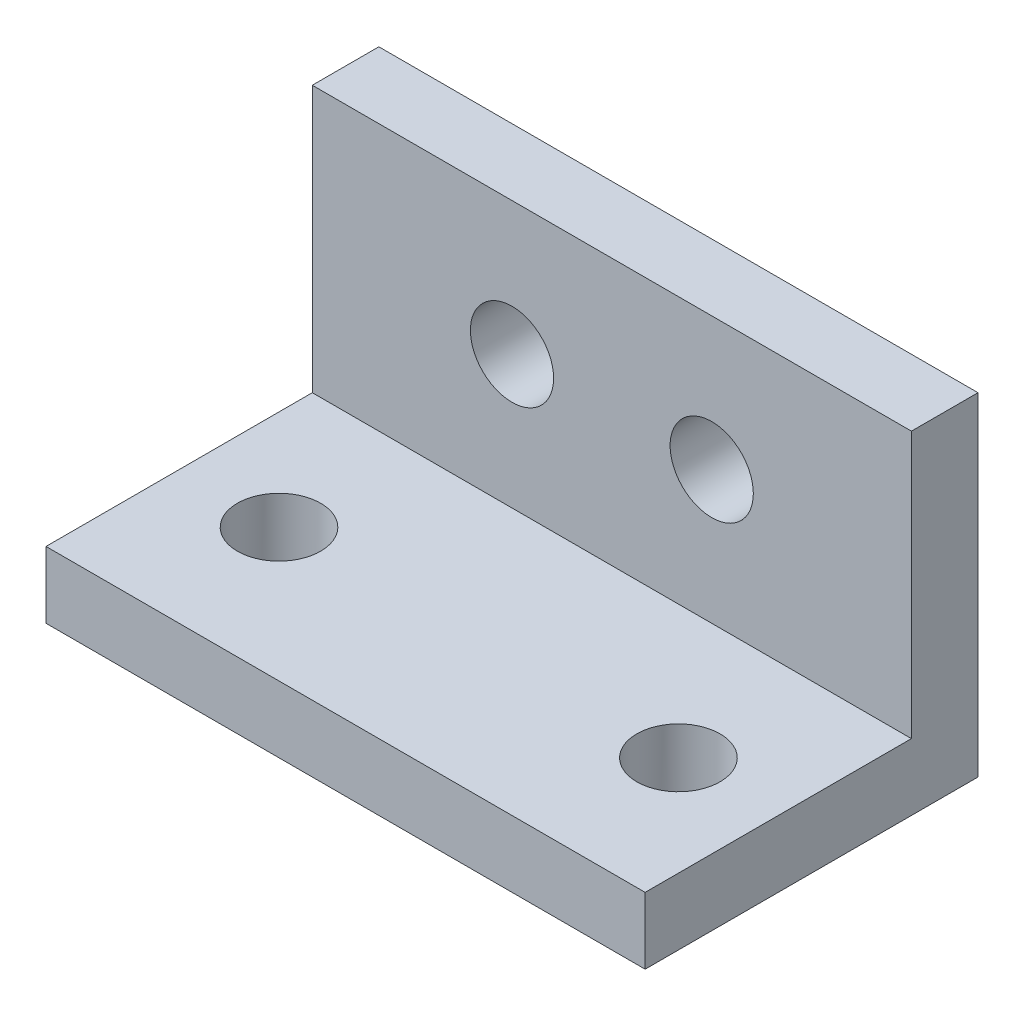
ISO-10303-21;
HEADER;
FILE_DESCRIPTION(('STEP AP214'),'2;1');
FILE_NAME('part.step','',(''),(''),'','','');
FILE_SCHEMA(('AUTOMOTIVE_DESIGN { 1 0 10303 214 1 1 1 1 }'));
ENDSEC;
DATA;
#1=APPLICATION_CONTEXT('core data for automotive mechanical design processes');
#2=APPLICATION_PROTOCOL_DEFINITION('international standard','automotive_design',2000,#1);
#3=PRODUCT_CONTEXT('',#1,'mechanical');
#4=PRODUCT('Part','Part','',(#3));
#5=PRODUCT_RELATED_PRODUCT_CATEGORY('part','',(#4));
#6=PRODUCT_DEFINITION_FORMATION('','',#4);
#7=PRODUCT_DEFINITION_CONTEXT('part definition',#1,'design');
#8=PRODUCT_DEFINITION('design','',#6,#7);
#9=PRODUCT_DEFINITION_SHAPE('','',#8);
#10=(LENGTH_UNIT() NAMED_UNIT(*) SI_UNIT(.MILLI.,.METRE.));
#11=(NAMED_UNIT(*) PLANE_ANGLE_UNIT() SI_UNIT($,.RADIAN.));
#12=(NAMED_UNIT(*) SI_UNIT($,.STERADIAN.) SOLID_ANGLE_UNIT());
#13=UNCERTAINTY_MEASURE_WITH_UNIT(LENGTH_MEASURE(1.E-05),#10,'distance_accuracy_value','');
#14=(GEOMETRIC_REPRESENTATION_CONTEXT(3) GLOBAL_UNCERTAINTY_ASSIGNED_CONTEXT((#13)) GLOBAL_UNIT_ASSIGNED_CONTEXT((#10,
#11,#12)) REPRESENTATION_CONTEXT('',''));
#15=CARTESIAN_POINT('',(0.,0.,0.));
#16=DIRECTION('',(0.,0.,1.));
#17=DIRECTION('',(1.,0.,0.));
#18=AXIS2_PLACEMENT_3D('',#15,#16,#17);
#19=CARTESIAN_POINT('',(57.15,0.,31.75));
#20=DIRECTION('',(0.,0.,1.));
#21=DIRECTION('',(1.,0.,0.));
#22=AXIS2_PLACEMENT_3D('',#19,#20,#21);
#23=PLANE('',#22);
#24=DIRECTION('',(0.,1.,0.));
#25=VECTOR('',#24,1.);
#26=CARTESIAN_POINT('',(0.,0.,31.75));
#27=LINE('',#26,#25);
#28=CARTESIAN_POINT('',(0.,0.,31.75));
#29=VERTEX_POINT('',#28);
#30=CARTESIAN_POINT('',(0.,6.35,31.75));
#31=VERTEX_POINT('',#30);
#32=EDGE_CURVE('E117',#29,#31,#27,.T.);
#33=ORIENTED_EDGE('',*,*,#32,.F.);
#34=DIRECTION('',(-1.,0.,0.));
#35=VECTOR('',#34,1.);
#36=CARTESIAN_POINT('',(57.15,0.,31.75));
#37=LINE('',#36,#35);
#38=CARTESIAN_POINT('',(57.15,0.,31.75));
#39=VERTEX_POINT('',#38);
#40=EDGE_CURVE('E11',#39,#29,#37,.T.);
#41=ORIENTED_EDGE('',*,*,#40,.F.);
#42=DIRECTION('',(0.,1.,0.));
#43=VECTOR('',#42,1.);
#44=CARTESIAN_POINT('',(57.15,0.,31.75));
#45=LINE('',#44,#43);
#46=CARTESIAN_POINT('',(57.15,6.35,31.75));
#47=VERTEX_POINT('',#46);
#48=EDGE_CURVE('E131',#39,#47,#45,.T.);
#49=ORIENTED_EDGE('',*,*,#48,.T.);
#50=DIRECTION('',(-1.,0.,0.));
#51=VECTOR('',#50,1.);
#52=CARTESIAN_POINT('',(57.15,6.35,31.75));
#53=LINE('',#52,#51);
#54=EDGE_CURVE('E79',#47,#31,#53,.T.);
#55=ORIENTED_EDGE('',*,*,#54,.T.);
#56=EDGE_LOOP('',(#33,#41,#49,#55));
#57=FACE_BOUND('',#56,.T.);
#58=ADVANCED_FACE('F35',(#57),#23,.T.);
#59=CARTESIAN_POINT('',(57.15,0.,0.));
#60=DIRECTION('',(0.,-1.,0.));
#61=DIRECTION('',(0.,0.,-1.));
#62=AXIS2_PLACEMENT_3D('',#59,#60,#61);
#63=PLANE('',#62);
#64=CARTESIAN_POINT('',(47.625,0.,19.05));
#65=DIRECTION('',(0.,-1.,0.));
#66=DIRECTION('',(0.,0.,-1.));
#67=AXIS2_PLACEMENT_3D('',#64,#65,#66);
#68=CIRCLE('',#67,3.96875);
#69=CARTESIAN_POINT('',(47.625,0.,15.08125));
#70=VERTEX_POINT('',#69);
#71=EDGE_CURVE('E166',#70,#70,#68,.F.);
#72=ORIENTED_EDGE('',*,*,#71,.T.);
#73=EDGE_LOOP('',(#72));
#74=FACE_BOUND('',#73,.T.);
#75=CARTESIAN_POINT('',(9.525,0.,19.05));
#76=DIRECTION('',(0.,-1.,0.));
#77=DIRECTION('',(0.,0.,-1.));
#78=AXIS2_PLACEMENT_3D('',#75,#76,#77);
#79=CIRCLE('',#78,3.96875);
#80=CARTESIAN_POINT('',(9.525,0.,15.08125));
#81=VERTEX_POINT('',#80);
#82=EDGE_CURVE('E160',#81,#81,#79,.F.);
#83=ORIENTED_EDGE('',*,*,#82,.T.);
#84=EDGE_LOOP('',(#83));
#85=FACE_BOUND('',#84,.T.);
#86=DIRECTION('',(0.,0.,1.));
#87=VECTOR('',#86,1.);
#88=CARTESIAN_POINT('',(0.,0.,0.));
#89=LINE('',#88,#87);
#90=CARTESIAN_POINT('',(0.,0.,0.));
#91=VERTEX_POINT('',#90);
#92=EDGE_CURVE('E120',#91,#29,#89,.T.);
#93=ORIENTED_EDGE('',*,*,#92,.F.);
#94=DIRECTION('',(-1.,0.,0.));
#95=VECTOR('',#94,1.);
#96=CARTESIAN_POINT('',(57.15,0.,0.));
#97=LINE('',#96,#95);
#98=CARTESIAN_POINT('',(57.15,0.,0.));
#99=VERTEX_POINT('',#98);
#100=EDGE_CURVE('E43',#99,#91,#97,.T.);
#101=ORIENTED_EDGE('',*,*,#100,.F.);
#102=DIRECTION('',(0.,0.,1.));
#103=VECTOR('',#102,1.);
#104=CARTESIAN_POINT('',(57.15,0.,0.));
#105=LINE('',#104,#103);
#106=EDGE_CURVE('E143',#99,#39,#105,.T.);
#107=ORIENTED_EDGE('',*,*,#106,.T.);
#108=ORIENTED_EDGE('',*,*,#40,.T.);
#109=EDGE_LOOP('',(#93,#101,#107,#108));
#110=FACE_BOUND('',#109,.T.);
#111=ADVANCED_FACE('F142',(#74,#85,#110),#63,.T.);
#112=CARTESIAN_POINT('',(57.15,0.,0.));
#113=DIRECTION('',(0.,0.,1.));
#114=DIRECTION('',(1.,0.,0.));
#115=AXIS2_PLACEMENT_3D('',#112,#113,#114);
#116=PLANE('',#115);
#117=CARTESIAN_POINT('',(38.1,19.05,0.));
#118=DIRECTION('',(0.,0.,1.));
#119=DIRECTION('',(1.,0.,0.));
#120=AXIS2_PLACEMENT_3D('',#117,#118,#119);
#121=CIRCLE('',#120,3.96875);
#122=CARTESIAN_POINT('',(42.06875,19.05,0.));
#123=VERTEX_POINT('',#122);
#124=EDGE_CURVE('E153',#123,#123,#121,.F.);
#125=ORIENTED_EDGE('',*,*,#124,.F.);
#126=EDGE_LOOP('',(#125));
#127=FACE_BOUND('',#126,.T.);
#128=CARTESIAN_POINT('',(19.05,19.05,0.));
#129=DIRECTION('',(0.,0.,1.));
#130=DIRECTION('',(1.,0.,0.));
#131=AXIS2_PLACEMENT_3D('',#128,#129,#130);
#132=CIRCLE('',#131,3.96874999999999);
#133=CARTESIAN_POINT('',(23.01875,19.05,0.));
#134=VERTEX_POINT('',#133);
#135=EDGE_CURVE('E121',#134,#134,#132,.F.);
#136=ORIENTED_EDGE('',*,*,#135,.F.);
#137=EDGE_LOOP('',(#136));
#138=FACE_BOUND('',#137,.T.);
#139=DIRECTION('',(0.,1.,0.));
#140=VECTOR('',#139,1.);
#141=CARTESIAN_POINT('',(0.,0.,0.));
#142=LINE('',#141,#140);
#143=CARTESIAN_POINT('',(0.,31.75,0.));
#144=VERTEX_POINT('',#143);
#145=EDGE_CURVE('E124',#91,#144,#142,.T.);
#146=ORIENTED_EDGE('',*,*,#145,.T.);
#147=DIRECTION('',(-1.,0.,0.));
#148=VECTOR('',#147,1.);
#149=CARTESIAN_POINT('',(57.15,31.75,0.));
#150=LINE('',#149,#148);
#151=CARTESIAN_POINT('',(57.15,31.75,0.));
#152=VERTEX_POINT('',#151);
#153=EDGE_CURVE('E110',#152,#144,#150,.T.);
#154=ORIENTED_EDGE('',*,*,#153,.F.);
#155=DIRECTION('',(0.,1.,0.));
#156=VECTOR('',#155,1.);
#157=CARTESIAN_POINT('',(57.15,0.,0.));
#158=LINE('',#157,#156);
#159=EDGE_CURVE('E97',#99,#152,#158,.T.);
#160=ORIENTED_EDGE('',*,*,#159,.F.);
#161=ORIENTED_EDGE('',*,*,#100,.T.);
#162=EDGE_LOOP('',(#146,#154,#160,#161));
#163=FACE_BOUND('',#162,.T.);
#164=ADVANCED_FACE('F136',(#127,#138,#163),#116,.F.);
#165=CARTESIAN_POINT('',(57.15,31.75,0.));
#166=DIRECTION('',(0.,-1.,0.));
#167=DIRECTION('',(0.,0.,-1.));
#168=AXIS2_PLACEMENT_3D('',#165,#166,#167);
#169=PLANE('',#168);
#170=DIRECTION('',(0.,0.,1.));
#171=VECTOR('',#170,1.);
#172=CARTESIAN_POINT('',(0.,31.75,0.));
#173=LINE('',#172,#171);
#174=CARTESIAN_POINT('',(0.,31.75,6.35));
#175=VERTEX_POINT('',#174);
#176=EDGE_CURVE('E106',#144,#175,#173,.T.);
#177=ORIENTED_EDGE('',*,*,#176,.T.);
#178=DIRECTION('',(-1.,0.,0.));
#179=VECTOR('',#178,1.);
#180=CARTESIAN_POINT('',(57.15,31.75,6.35));
#181=LINE('',#180,#179);
#182=CARTESIAN_POINT('',(57.15,31.75,6.35));
#183=VERTEX_POINT('',#182);
#184=EDGE_CURVE('E103',#183,#175,#181,.T.);
#185=ORIENTED_EDGE('',*,*,#184,.F.);
#186=DIRECTION('',(0.,0.,1.));
#187=VECTOR('',#186,1.);
#188=CARTESIAN_POINT('',(57.15,31.75,0.));
#189=LINE('',#188,#187);
#190=EDGE_CURVE('E90',#152,#183,#189,.T.);
#191=ORIENTED_EDGE('',*,*,#190,.F.);
#192=ORIENTED_EDGE('',*,*,#153,.T.);
#193=EDGE_LOOP('',(#177,#185,#191,#192));
#194=FACE_BOUND('',#193,.T.);
#195=ADVANCED_FACE('F104',(#194),#169,.F.);
#196=CARTESIAN_POINT('',(57.15,0.,6.35));
#197=DIRECTION('',(0.,0.,1.));
#198=DIRECTION('',(1.,0.,0.));
#199=AXIS2_PLACEMENT_3D('',#196,#197,#198);
#200=PLANE('',#199);
#201=CARTESIAN_POINT('',(38.1,19.05,6.35));
#202=DIRECTION('',(0.,0.,1.));
#203=DIRECTION('',(1.,0.,0.));
#204=AXIS2_PLACEMENT_3D('',#201,#202,#203);
#205=CIRCLE('',#204,3.96875);
#206=CARTESIAN_POINT('',(42.06875,19.05,6.35));
#207=VERTEX_POINT('',#206);
#208=EDGE_CURVE('E156',#207,#207,#205,.T.);
#209=ORIENTED_EDGE('',*,*,#208,.F.);
#210=EDGE_LOOP('',(#209));
#211=FACE_BOUND('',#210,.T.);
#212=CARTESIAN_POINT('',(19.05,19.05,6.35));
#213=DIRECTION('',(0.,0.,1.));
#214=DIRECTION('',(1.,0.,0.));
#215=AXIS2_PLACEMENT_3D('',#212,#213,#214);
#216=CIRCLE('',#215,3.96874999999999);
#217=CARTESIAN_POINT('',(23.01875,19.05,6.35));
#218=VERTEX_POINT('',#217);
#219=EDGE_CURVE('E150',#218,#218,#216,.T.);
#220=ORIENTED_EDGE('',*,*,#219,.F.);
#221=EDGE_LOOP('',(#220));
#222=FACE_BOUND('',#221,.T.);
#223=DIRECTION('',(0.,1.,0.));
#224=VECTOR('',#223,1.);
#225=CARTESIAN_POINT('',(0.,0.,6.35));
#226=LINE('',#225,#224);
#227=CARTESIAN_POINT('',(0.,6.35,6.35));
#228=VERTEX_POINT('',#227);
#229=EDGE_CURVE('E127',#228,#175,#226,.T.);
#230=ORIENTED_EDGE('',*,*,#229,.F.);
#231=DIRECTION('',(-1.,0.,0.));
#232=VECTOR('',#231,1.);
#233=CARTESIAN_POINT('',(57.15,6.35,6.35));
#234=LINE('',#233,#232);
#235=CARTESIAN_POINT('',(57.15,6.35,6.35));
#236=VERTEX_POINT('',#235);
#237=EDGE_CURVE('E72',#236,#228,#234,.T.);
#238=ORIENTED_EDGE('',*,*,#237,.F.);
#239=DIRECTION('',(0.,1.,0.));
#240=VECTOR('',#239,1.);
#241=CARTESIAN_POINT('',(57.15,0.,6.35));
#242=LINE('',#241,#240);
#243=EDGE_CURVE('E94',#236,#183,#242,.T.);
#244=ORIENTED_EDGE('',*,*,#243,.T.);
#245=ORIENTED_EDGE('',*,*,#184,.T.);
#246=EDGE_LOOP('',(#230,#238,#244,#245));
#247=FACE_BOUND('',#246,.T.);
#248=ADVANCED_FACE('F112',(#211,#222,#247),#200,.T.);
#249=CARTESIAN_POINT('',(57.15,6.35,0.));
#250=DIRECTION('',(0.,-1.,0.));
#251=DIRECTION('',(0.,0.,-1.));
#252=AXIS2_PLACEMENT_3D('',#249,#250,#251);
#253=PLANE('',#252);
#254=CARTESIAN_POINT('',(47.625,6.35,19.05));
#255=DIRECTION('',(0.,1.,0.));
#256=DIRECTION('',(0.,0.,1.));
#257=AXIS2_PLACEMENT_3D('',#254,#255,#256);
#258=CIRCLE('',#257,3.96875);
#259=CARTESIAN_POINT('',(47.625,6.35,23.01875));
#260=VERTEX_POINT('',#259);
#261=EDGE_CURVE('E163',#260,#260,#258,.T.);
#262=ORIENTED_EDGE('',*,*,#261,.F.);
#263=EDGE_LOOP('',(#262));
#264=FACE_BOUND('',#263,.T.);
#265=CARTESIAN_POINT('',(9.525,6.35,19.05));
#266=DIRECTION('',(0.,1.,0.));
#267=DIRECTION('',(0.,0.,1.));
#268=AXIS2_PLACEMENT_3D('',#265,#266,#267);
#269=CIRCLE('',#268,3.96875);
#270=CARTESIAN_POINT('',(9.525,6.35,23.01875));
#271=VERTEX_POINT('',#270);
#272=EDGE_CURVE('E159',#271,#271,#269,.T.);
#273=ORIENTED_EDGE('',*,*,#272,.F.);
#274=EDGE_LOOP('',(#273));
#275=FACE_BOUND('',#274,.T.);
#276=DIRECTION('',(0.,0.,1.));
#277=VECTOR('',#276,1.);
#278=CARTESIAN_POINT('',(0.,6.35,0.));
#279=LINE('',#278,#277);
#280=EDGE_CURVE('E129',#228,#31,#279,.T.);
#281=ORIENTED_EDGE('',*,*,#280,.T.);
#282=ORIENTED_EDGE('',*,*,#54,.F.);
#283=DIRECTION('',(0.,0.,1.));
#284=VECTOR('',#283,1.);
#285=CARTESIAN_POINT('',(57.15,6.35,0.));
#286=LINE('',#285,#284);
#287=EDGE_CURVE('E51',#236,#47,#286,.T.);
#288=ORIENTED_EDGE('',*,*,#287,.F.);
#289=ORIENTED_EDGE('',*,*,#237,.T.);
#290=EDGE_LOOP('',(#281,#282,#288,#289));
#291=FACE_BOUND('',#290,.T.);
#292=ADVANCED_FACE('F144',(#264,#275,#291),#253,.F.);
#293=CARTESIAN_POINT('',(57.15,0.,0.));
#294=DIRECTION('',(1.,0.,0.));
#295=DIRECTION('',(0.,0.,-1.));
#296=AXIS2_PLACEMENT_3D('',#293,#294,#295);
#297=PLANE('',#296);
#298=ORIENTED_EDGE('',*,*,#48,.F.);
#299=ORIENTED_EDGE('',*,*,#106,.F.);
#300=ORIENTED_EDGE('',*,*,#159,.T.);
#301=ORIENTED_EDGE('',*,*,#190,.T.);
#302=ORIENTED_EDGE('',*,*,#243,.F.);
#303=ORIENTED_EDGE('',*,*,#287,.T.);
#304=EDGE_LOOP('',(#298,#299,#300,#301,#302,#303));
#305=FACE_BOUND('',#304,.T.);
#306=ADVANCED_FACE('F92',(#305),#297,.T.);
#307=CARTESIAN_POINT('',(0.,0.,0.));
#308=DIRECTION('',(1.,0.,0.));
#309=DIRECTION('',(0.,0.,-1.));
#310=AXIS2_PLACEMENT_3D('',#307,#308,#309);
#311=PLANE('',#310);
#312=ORIENTED_EDGE('',*,*,#32,.T.);
#313=ORIENTED_EDGE('',*,*,#280,.F.);
#314=ORIENTED_EDGE('',*,*,#229,.T.);
#315=ORIENTED_EDGE('',*,*,#176,.F.);
#316=ORIENTED_EDGE('',*,*,#145,.F.);
#317=ORIENTED_EDGE('',*,*,#92,.T.);
#318=EDGE_LOOP('',(#312,#313,#314,#315,#316,#317));
#319=FACE_BOUND('',#318,.T.);
#320=ADVANCED_FACE('F141',(#319),#311,.F.);
#321=CARTESIAN_POINT('',(19.05,19.05,-0.00100000000000013));
#322=DIRECTION('',(0.,0.,1.));
#323=DIRECTION('',(1.,0.,0.));
#324=AXIS2_PLACEMENT_3D('',#321,#322,#323);
#325=CYLINDRICAL_SURFACE('',#324,3.96874999999999);
#326=ORIENTED_EDGE('',*,*,#219,.T.);
#327=EDGE_LOOP('',(#326));
#328=FACE_BOUND('',#327,.T.);
#329=ORIENTED_EDGE('',*,*,#135,.T.);
#330=EDGE_LOOP('',(#329));
#331=FACE_BOUND('',#330,.T.);
#332=ADVANCED_FACE('F190',(#328,#331),#325,.F.);
#333=CARTESIAN_POINT('',(38.1,19.05,-0.00100000000000013));
#334=DIRECTION('',(0.,0.,1.));
#335=DIRECTION('',(1.,0.,0.));
#336=AXIS2_PLACEMENT_3D('',#333,#334,#335);
#337=CYLINDRICAL_SURFACE('',#336,3.96875);
#338=ORIENTED_EDGE('',*,*,#208,.T.);
#339=EDGE_LOOP('',(#338));
#340=FACE_BOUND('',#339,.T.);
#341=ORIENTED_EDGE('',*,*,#124,.T.);
#342=EDGE_LOOP('',(#341));
#343=FACE_BOUND('',#342,.T.);
#344=ADVANCED_FACE('F181',(#340,#343),#337,.F.);
#345=CARTESIAN_POINT('',(9.525,-0.0010000000000062,19.05));
#346=DIRECTION('',(0.,1.,0.));
#347=DIRECTION('',(0.,0.,1.));
#348=AXIS2_PLACEMENT_3D('',#345,#346,#347);
#349=CYLINDRICAL_SURFACE('',#348,3.96875);
#350=ORIENTED_EDGE('',*,*,#82,.F.);
#351=EDGE_LOOP('',(#350));
#352=FACE_BOUND('',#351,.T.);
#353=ORIENTED_EDGE('',*,*,#272,.T.);
#354=EDGE_LOOP('',(#353));
#355=FACE_BOUND('',#354,.T.);
#356=ADVANCED_FACE('F179',(#352,#355),#349,.F.);
#357=CARTESIAN_POINT('',(47.625,-0.0010000000000062,19.05));
#358=DIRECTION('',(0.,1.,0.));
#359=DIRECTION('',(0.,0.,1.));
#360=AXIS2_PLACEMENT_3D('',#357,#358,#359);
#361=CYLINDRICAL_SURFACE('',#360,3.96875);
#362=ORIENTED_EDGE('',*,*,#71,.F.);
#363=EDGE_LOOP('',(#362));
#364=FACE_BOUND('',#363,.T.);
#365=ORIENTED_EDGE('',*,*,#261,.T.);
#366=EDGE_LOOP('',(#365));
#367=FACE_BOUND('',#366,.T.);
#368=ADVANCED_FACE('F172',(#364,#367),#361,.F.);
#369=CLOSED_SHELL('',(#58,#111,#164,#195,#248,#292,#306,#320,#332,#344,#356,#368));
#370=MANIFOLD_SOLID_BREP('B2',#369);
#371=ADVANCED_BREP_SHAPE_REPRESENTATION('',(#18,#370),#14);
#372=SHAPE_DEFINITION_REPRESENTATION(#9,#371);
ENDSEC;
END-ISO-10303-21;
